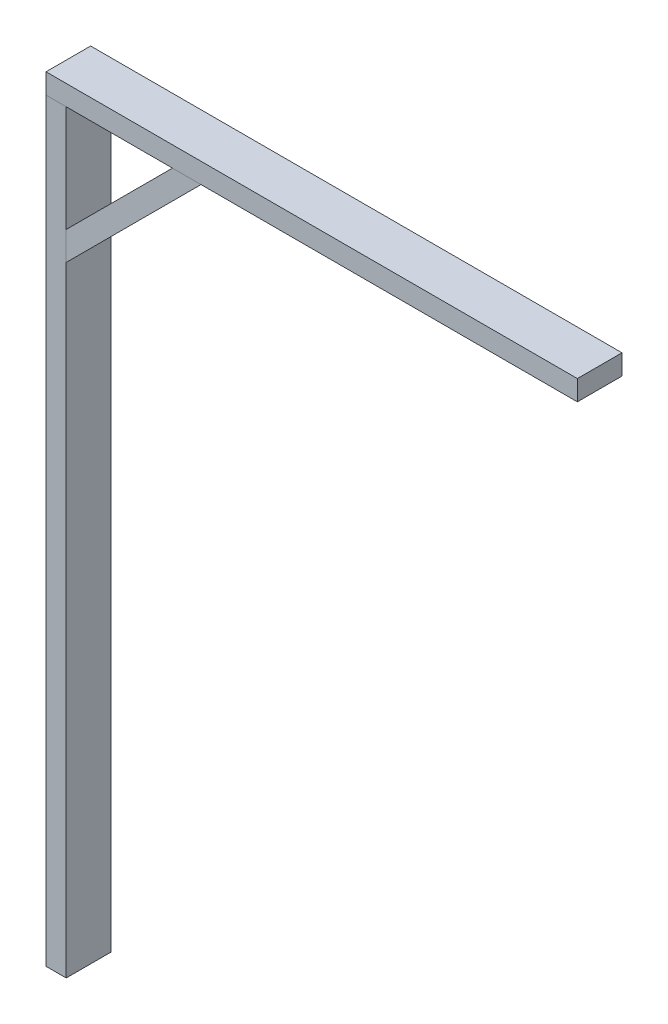
ISO-10303-21;
HEADER;
FILE_DESCRIPTION(('STEP AP214'),'2;1');
FILE_NAME('part.step','',(''),(''),'','','');
FILE_SCHEMA(('AUTOMOTIVE_DESIGN { 1 0 10303 214 1 1 1 1 }'));
ENDSEC;
DATA;
#1=APPLICATION_CONTEXT('core data for automotive mechanical design processes');
#2=APPLICATION_PROTOCOL_DEFINITION('international standard','automotive_design',2000,#1);
#3=PRODUCT_CONTEXT('',#1,'mechanical');
#4=PRODUCT('Part','Part','',(#3));
#5=PRODUCT_RELATED_PRODUCT_CATEGORY('part','',(#4));
#6=PRODUCT_DEFINITION_FORMATION('','',#4);
#7=PRODUCT_DEFINITION_CONTEXT('part definition',#1,'design');
#8=PRODUCT_DEFINITION('design','',#6,#7);
#9=PRODUCT_DEFINITION_SHAPE('','',#8);
#10=(LENGTH_UNIT() NAMED_UNIT(*) SI_UNIT(.MILLI.,.METRE.));
#11=(NAMED_UNIT(*) PLANE_ANGLE_UNIT() SI_UNIT($,.RADIAN.));
#12=(NAMED_UNIT(*) SI_UNIT($,.STERADIAN.) SOLID_ANGLE_UNIT());
#13=UNCERTAINTY_MEASURE_WITH_UNIT(LENGTH_MEASURE(1.E-05),#10,'distance_accuracy_value','');
#14=(GEOMETRIC_REPRESENTATION_CONTEXT(3) GLOBAL_UNCERTAINTY_ASSIGNED_CONTEXT((#13)) GLOBAL_UNIT_ASSIGNED_CONTEXT((#10,
#11,#12)) REPRESENTATION_CONTEXT('',''));
#15=CARTESIAN_POINT('',(0.,0.,0.));
#16=DIRECTION('',(0.,0.,1.));
#17=DIRECTION('',(1.,0.,0.));
#18=AXIS2_PLACEMENT_3D('',#15,#16,#17);
#19=CARTESIAN_POINT('',(490.5,710.,-21.));
#20=DIRECTION('',(0.,0.,-1.));
#21=DIRECTION('',(-1.,0.,0.));
#22=AXIS2_PLACEMENT_3D('',#19,#20,#21);
#23=PLANE('',#22);
#24=DIRECTION('',(-0.707106781186548,-0.707106781186547,0.));
#25=VECTOR('',#24,1.);
#26=CARTESIAN_POINT('',(109.5,710.,-21.));
#27=LINE('',#26,#25);
#28=CARTESIAN_POINT('',(109.5,710.,-21.));
#29=VERTEX_POINT('',#28);
#30=CARTESIAN_POINT('',(9.50000000000001,610.,-21.));
#31=VERTEX_POINT('',#30);
#32=EDGE_CURVE('E58',#29,#31,#27,.T.);
#33=ORIENTED_EDGE('',*,*,#32,.F.);
#34=DIRECTION('',(-1.,0.,0.));
#35=VECTOR('',#34,1.);
#36=CARTESIAN_POINT('',(109.5,710.,-21.));
#37=LINE('',#36,#35);
#38=CARTESIAN_POINT('',(136.370057685089,710.,-21.));
#39=VERTEX_POINT('',#38);
#40=EDGE_CURVE('E81',#39,#29,#37,.T.);
#41=ORIENTED_EDGE('',*,*,#40,.F.);
#42=DIRECTION('',(0.707106781186547,0.707106781186548,0.));
#43=VECTOR('',#42,1.);
#44=CARTESIAN_POINT('',(136.370057685089,710.,-21.));
#45=LINE('',#44,#43);
#46=CARTESIAN_POINT('',(9.5,583.129942314911,-21.));
#47=VERTEX_POINT('',#46);
#48=EDGE_CURVE('E86',#47,#39,#45,.T.);
#49=ORIENTED_EDGE('',*,*,#48,.F.);
#50=DIRECTION('',(0.,-1.,0.));
#51=VECTOR('',#50,1.);
#52=CARTESIAN_POINT('',(9.50000000000001,610.,-21.));
#53=LINE('',#52,#51);
#54=EDGE_CURVE('E101',#31,#47,#53,.T.);
#55=ORIENTED_EDGE('',*,*,#54,.F.);
#56=EDGE_LOOP('',(#33,#41,#49,#55));
#57=FACE_BOUND('',#56,.T.);
#58=ADVANCED_FACE('F50',(#57),#23,.T.);
#59=CARTESIAN_POINT('',(0.,0.,21.));
#60=DIRECTION('',(0.,0.,1.));
#61=DIRECTION('',(1.,0.,0.));
#62=AXIS2_PLACEMENT_3D('',#59,#60,#61);
#63=PLANE('',#62);
#64=DIRECTION('',(-0.707106781186548,-0.707106781186547,0.));
#65=VECTOR('',#64,1.);
#66=CARTESIAN_POINT('',(109.5,710.,21.));
#67=LINE('',#66,#65);
#68=CARTESIAN_POINT('',(109.5,710.,21.));
#69=VERTEX_POINT('',#68);
#70=CARTESIAN_POINT('',(9.50000000000001,610.,21.));
#71=VERTEX_POINT('',#70);
#72=EDGE_CURVE('E110',#69,#71,#67,.T.);
#73=ORIENTED_EDGE('',*,*,#72,.T.);
#74=DIRECTION('',(0.,-1.,0.));
#75=VECTOR('',#74,1.);
#76=CARTESIAN_POINT('',(9.50000000000001,610.,21.));
#77=LINE('',#76,#75);
#78=CARTESIAN_POINT('',(9.5,583.129942314911,21.));
#79=VERTEX_POINT('',#78);
#80=EDGE_CURVE('E99',#71,#79,#77,.T.);
#81=ORIENTED_EDGE('',*,*,#80,.T.);
#82=DIRECTION('',(0.707106781186547,0.707106781186548,0.));
#83=VECTOR('',#82,1.);
#84=CARTESIAN_POINT('',(136.370057685089,710.,21.));
#85=LINE('',#84,#83);
#86=CARTESIAN_POINT('',(136.370057685089,710.,21.));
#87=VERTEX_POINT('',#86);
#88=EDGE_CURVE('E102',#79,#87,#85,.T.);
#89=ORIENTED_EDGE('',*,*,#88,.T.);
#90=DIRECTION('',(-1.,0.,0.));
#91=VECTOR('',#90,1.);
#92=CARTESIAN_POINT('',(109.5,710.,21.));
#93=LINE('',#92,#91);
#94=EDGE_CURVE('E107',#87,#69,#93,.T.);
#95=ORIENTED_EDGE('',*,*,#94,.T.);
#96=EDGE_LOOP('',(#73,#81,#89,#95));
#97=FACE_BOUND('',#96,.T.);
#98=ADVANCED_FACE('F109',(#97),#63,.T.);
#99=CARTESIAN_POINT('',(9.50000000000001,610.,-200.42135623731));
#100=DIRECTION('',(-1.,0.,0.));
#101=DIRECTION('',(0.,-1.,0.));
#102=AXIS2_PLACEMENT_3D('',#99,#100,#101);
#103=PLANE('',#102);
#104=DIRECTION('',(0.,0.,1.));
#105=VECTOR('',#104,1.);
#106=CARTESIAN_POINT('',(9.50000000000001,610.,-200.42135623731));
#107=LINE('',#106,#105);
#108=EDGE_CURVE('E12',#31,#71,#107,.T.);
#109=ORIENTED_EDGE('',*,*,#108,.F.);
#110=ORIENTED_EDGE('',*,*,#54,.T.);
#111=DIRECTION('',(0.,0.,1.));
#112=VECTOR('',#111,1.);
#113=CARTESIAN_POINT('',(9.5,583.129942314911,-200.42135623731));
#114=LINE('',#113,#112);
#115=EDGE_CURVE('E96',#47,#79,#114,.T.);
#116=ORIENTED_EDGE('',*,*,#115,.T.);
#117=ORIENTED_EDGE('',*,*,#80,.F.);
#118=EDGE_LOOP('',(#109,#110,#116,#117));
#119=FACE_BOUND('',#118,.T.);
#120=ADVANCED_FACE('F97',(#119),#103,.T.);
#121=CARTESIAN_POINT('',(136.370057685089,710.,-200.42135623731));
#122=DIRECTION('',(0.707106781186548,-0.707106781186547,0.));
#123=DIRECTION('',(0.707106781186547,0.707106781186548,0.));
#124=AXIS2_PLACEMENT_3D('',#121,#122,#123);
#125=PLANE('',#124);
#126=ORIENTED_EDGE('',*,*,#115,.F.);
#127=ORIENTED_EDGE('',*,*,#48,.T.);
#128=DIRECTION('',(0.,0.,1.));
#129=VECTOR('',#128,1.);
#130=CARTESIAN_POINT('',(136.370057685089,710.,-200.42135623731));
#131=LINE('',#130,#129);
#132=EDGE_CURVE('E91',#39,#87,#131,.T.);
#133=ORIENTED_EDGE('',*,*,#132,.T.);
#134=ORIENTED_EDGE('',*,*,#88,.F.);
#135=EDGE_LOOP('',(#126,#127,#133,#134));
#136=FACE_BOUND('',#135,.T.);
#137=ADVANCED_FACE('F103',(#136),#125,.T.);
#138=CARTESIAN_POINT('',(109.5,710.,-200.42135623731));
#139=DIRECTION('',(0.,1.,0.));
#140=DIRECTION('',(0.,0.,1.));
#141=AXIS2_PLACEMENT_3D('',#138,#139,#140);
#142=PLANE('',#141);
#143=ORIENTED_EDGE('',*,*,#132,.F.);
#144=ORIENTED_EDGE('',*,*,#40,.T.);
#145=DIRECTION('',(0.,0.,1.));
#146=VECTOR('',#145,1.);
#147=CARTESIAN_POINT('',(109.5,710.,-200.42135623731));
#148=LINE('',#147,#146);
#149=EDGE_CURVE('E117',#29,#69,#148,.T.);
#150=ORIENTED_EDGE('',*,*,#149,.T.);
#151=ORIENTED_EDGE('',*,*,#94,.F.);
#152=EDGE_LOOP('',(#143,#144,#150,#151));
#153=FACE_BOUND('',#152,.T.);
#154=ADVANCED_FACE('F123',(#153),#142,.T.);
#155=CARTESIAN_POINT('',(109.5,710.,-200.42135623731));
#156=DIRECTION('',(-0.707106781186547,0.707106781186548,0.));
#157=DIRECTION('',(-0.707106781186548,-0.707106781186547,0.));
#158=AXIS2_PLACEMENT_3D('',#155,#156,#157);
#159=PLANE('',#158);
#160=ORIENTED_EDGE('',*,*,#149,.F.);
#161=ORIENTED_EDGE('',*,*,#32,.T.);
#162=ORIENTED_EDGE('',*,*,#108,.T.);
#163=ORIENTED_EDGE('',*,*,#72,.F.);
#164=EDGE_LOOP('',(#160,#161,#162,#163));
#165=FACE_BOUND('',#164,.T.);
#166=ADVANCED_FACE('F124',(#165),#159,.T.);
#167=CLOSED_SHELL('',(#58,#98,#120,#137,#154,#166));
#168=MANIFOLD_SOLID_BREP('B2',#167);
#169=CARTESIAN_POINT('',(490.5,710.,-21.));
#170=DIRECTION('',(0.,0.,-1.));
#171=DIRECTION('',(-1.,0.,0.));
#172=AXIS2_PLACEMENT_3D('',#169,#170,#171);
#173=PLANE('',#172);
#174=DIRECTION('',(0.,-1.,0.));
#175=VECTOR('',#174,1.);
#176=CARTESIAN_POINT('',(-9.5,710.,-21.));
#177=LINE('',#176,#175);
#178=CARTESIAN_POINT('',(-9.5,729.,-21.));
#179=VERTEX_POINT('',#178);
#180=CARTESIAN_POINT('',(-9.5,710.,-21.));
#181=VERTEX_POINT('',#180);
#182=EDGE_CURVE('E247',#179,#181,#177,.T.);
#183=ORIENTED_EDGE('',*,*,#182,.F.);
#184=DIRECTION('',(-1.,0.,0.));
#185=VECTOR('',#184,1.);
#186=CARTESIAN_POINT('',(490.5,729.,-21.));
#187=LINE('',#186,#185);
#188=CARTESIAN_POINT('',(490.5,729.,-21.));
#189=VERTEX_POINT('',#188);
#190=EDGE_CURVE('E48',#189,#179,#187,.T.);
#191=ORIENTED_EDGE('',*,*,#190,.F.);
#192=DIRECTION('',(0.,-1.,0.));
#193=VECTOR('',#192,1.);
#194=CARTESIAN_POINT('',(490.5,710.,-21.));
#195=LINE('',#194,#193);
#196=CARTESIAN_POINT('',(490.5,710.,-21.));
#197=VERTEX_POINT('',#196);
#198=EDGE_CURVE('E241',#189,#197,#195,.T.);
#199=ORIENTED_EDGE('',*,*,#198,.T.);
#200=DIRECTION('',(-1.,0.,0.));
#201=VECTOR('',#200,1.);
#202=CARTESIAN_POINT('',(490.5,710.,-21.));
#203=LINE('',#202,#201);
#204=EDGE_CURVE('E186',#197,#181,#203,.T.);
#205=ORIENTED_EDGE('',*,*,#204,.T.);
#206=EDGE_LOOP('',(#183,#191,#199,#205));
#207=FACE_BOUND('',#206,.T.);
#208=ADVANCED_FACE('F183',(#207),#173,.T.);
#209=CARTESIAN_POINT('',(490.5,729.,-21.));
#210=DIRECTION('',(0.,1.,0.));
#211=DIRECTION('',(0.,0.,1.));
#212=AXIS2_PLACEMENT_3D('',#209,#210,#211);
#213=PLANE('',#212);
#214=DIRECTION('',(0.,0.,-1.));
#215=VECTOR('',#214,1.);
#216=CARTESIAN_POINT('',(-9.5,729.,-21.));
#217=LINE('',#216,#215);
#218=CARTESIAN_POINT('',(-9.5,729.,21.));
#219=VERTEX_POINT('',#218);
#220=EDGE_CURVE('E243',#219,#179,#217,.T.);
#221=ORIENTED_EDGE('',*,*,#220,.F.);
#222=DIRECTION('',(-1.,0.,0.));
#223=VECTOR('',#222,1.);
#224=CARTESIAN_POINT('',(490.5,729.,21.));
#225=LINE('',#224,#223);
#226=CARTESIAN_POINT('',(490.5,729.,21.));
#227=VERTEX_POINT('',#226);
#228=EDGE_CURVE('E192',#227,#219,#225,.T.);
#229=ORIENTED_EDGE('',*,*,#228,.F.);
#230=DIRECTION('',(0.,0.,-1.));
#231=VECTOR('',#230,1.);
#232=CARTESIAN_POINT('',(490.5,729.,-21.));
#233=LINE('',#232,#231);
#234=EDGE_CURVE('E238',#227,#189,#233,.T.);
#235=ORIENTED_EDGE('',*,*,#234,.T.);
#236=ORIENTED_EDGE('',*,*,#190,.T.);
#237=EDGE_LOOP('',(#221,#229,#235,#236));
#238=FACE_BOUND('',#237,.T.);
#239=ADVANCED_FACE('F257',(#238),#213,.T.);
#240=CARTESIAN_POINT('',(490.5,710.,21.));
#241=DIRECTION('',(0.,0.,1.));
#242=DIRECTION('',(1.,0.,0.));
#243=AXIS2_PLACEMENT_3D('',#240,#241,#242);
#244=PLANE('',#243);
#245=DIRECTION('',(0.,1.,0.));
#246=VECTOR('',#245,1.);
#247=CARTESIAN_POINT('',(-9.5,710.,21.));
#248=LINE('',#247,#246);
#249=CARTESIAN_POINT('',(-9.5,710.,21.));
#250=VERTEX_POINT('',#249);
#251=EDGE_CURVE('E233',#250,#219,#248,.T.);
#252=ORIENTED_EDGE('',*,*,#251,.F.);
#253=DIRECTION('',(-1.,0.,0.));
#254=VECTOR('',#253,1.);
#255=CARTESIAN_POINT('',(490.5,710.,21.));
#256=LINE('',#255,#254);
#257=CARTESIAN_POINT('',(490.5,710.,21.));
#258=VERTEX_POINT('',#257);
#259=EDGE_CURVE('E228',#258,#250,#256,.T.);
#260=ORIENTED_EDGE('',*,*,#259,.F.);
#261=DIRECTION('',(0.,1.,0.));
#262=VECTOR('',#261,1.);
#263=CARTESIAN_POINT('',(490.5,710.,21.));
#264=LINE('',#263,#262);
#265=EDGE_CURVE('E231',#258,#227,#264,.T.);
#266=ORIENTED_EDGE('',*,*,#265,.T.);
#267=ORIENTED_EDGE('',*,*,#228,.T.);
#268=EDGE_LOOP('',(#252,#260,#266,#267));
#269=FACE_BOUND('',#268,.T.);
#270=ADVANCED_FACE('F230',(#269),#244,.T.);
#271=CARTESIAN_POINT('',(490.5,710.,-21.));
#272=DIRECTION('',(0.,-1.,0.));
#273=DIRECTION('',(0.,0.,-1.));
#274=AXIS2_PLACEMENT_3D('',#271,#272,#273);
#275=PLANE('',#274);
#276=DIRECTION('',(0.,0.,1.));
#277=VECTOR('',#276,1.);
#278=CARTESIAN_POINT('',(-9.5,710.,-21.));
#279=LINE('',#278,#277);
#280=EDGE_CURVE('E250',#181,#250,#279,.T.);
#281=ORIENTED_EDGE('',*,*,#280,.F.);
#282=ORIENTED_EDGE('',*,*,#204,.F.);
#283=DIRECTION('',(0.,0.,1.));
#284=VECTOR('',#283,1.);
#285=CARTESIAN_POINT('',(490.5,710.,-21.));
#286=LINE('',#285,#284);
#287=EDGE_CURVE('E237',#197,#258,#286,.T.);
#288=ORIENTED_EDGE('',*,*,#287,.T.);
#289=ORIENTED_EDGE('',*,*,#259,.T.);
#290=EDGE_LOOP('',(#281,#282,#288,#289));
#291=FACE_BOUND('',#290,.T.);
#292=ADVANCED_FACE('F240',(#291),#275,.T.);
#293=CARTESIAN_POINT('',(490.5,0.,0.));
#294=DIRECTION('',(1.,0.,0.));
#295=DIRECTION('',(0.,0.,-1.));
#296=AXIS2_PLACEMENT_3D('',#293,#294,#295);
#297=PLANE('',#296);
#298=ORIENTED_EDGE('',*,*,#198,.F.);
#299=ORIENTED_EDGE('',*,*,#234,.F.);
#300=ORIENTED_EDGE('',*,*,#265,.F.);
#301=ORIENTED_EDGE('',*,*,#287,.F.);
#302=EDGE_LOOP('',(#298,#299,#300,#301));
#303=FACE_BOUND('',#302,.T.);
#304=ADVANCED_FACE('F236',(#303),#297,.T.);
#305=CARTESIAN_POINT('',(-9.5,0.,0.));
#306=DIRECTION('',(1.,0.,0.));
#307=DIRECTION('',(0.,0.,-1.));
#308=AXIS2_PLACEMENT_3D('',#305,#306,#307);
#309=PLANE('',#308);
#310=ORIENTED_EDGE('',*,*,#182,.T.);
#311=ORIENTED_EDGE('',*,*,#280,.T.);
#312=ORIENTED_EDGE('',*,*,#251,.T.);
#313=ORIENTED_EDGE('',*,*,#220,.T.);
#314=EDGE_LOOP('',(#310,#311,#312,#313));
#315=FACE_BOUND('',#314,.T.);
#316=ADVANCED_FACE('F256',(#315),#309,.F.);
#317=CLOSED_SHELL('',(#208,#239,#270,#292,#304,#316));
#318=MANIFOLD_SOLID_BREP('B6',#317);
#319=CARTESIAN_POINT('',(-9.5,710.,21.));
#320=DIRECTION('',(1.,0.,0.));
#321=DIRECTION('',(0.,0.,-1.));
#322=AXIS2_PLACEMENT_3D('',#319,#320,#321);
#323=PLANE('',#322);
#324=DIRECTION('',(0.,0.,1.));
#325=VECTOR('',#324,1.);
#326=CARTESIAN_POINT('',(-9.5,0.,21.));
#327=LINE('',#326,#325);
#328=CARTESIAN_POINT('',(-9.5,0.,-21.));
#329=VERTEX_POINT('',#328);
#330=CARTESIAN_POINT('',(-9.5,0.,21.));
#331=VERTEX_POINT('',#330);
#332=EDGE_CURVE('E375',#329,#331,#327,.T.);
#333=ORIENTED_EDGE('',*,*,#332,.T.);
#334=DIRECTION('',(0.,-1.,0.));
#335=VECTOR('',#334,1.);
#336=CARTESIAN_POINT('',(-9.5,710.,21.));
#337=LINE('',#336,#335);
#338=CARTESIAN_POINT('',(-9.5,710.,21.));
#339=VERTEX_POINT('',#338);
#340=EDGE_CURVE('E181',#339,#331,#337,.T.);
#341=ORIENTED_EDGE('',*,*,#340,.F.);
#342=DIRECTION('',(0.,0.,1.));
#343=VECTOR('',#342,1.);
#344=CARTESIAN_POINT('',(-9.5,710.,21.));
#345=LINE('',#344,#343);
#346=CARTESIAN_POINT('',(-9.5,710.,-21.));
#347=VERTEX_POINT('',#346);
#348=EDGE_CURVE('E359',#347,#339,#345,.T.);
#349=ORIENTED_EDGE('',*,*,#348,.F.);
#350=DIRECTION('',(0.,-1.,0.));
#351=VECTOR('',#350,1.);
#352=CARTESIAN_POINT('',(-9.5,710.,-21.));
#353=LINE('',#352,#351);
#354=EDGE_CURVE('E371',#347,#329,#353,.T.);
#355=ORIENTED_EDGE('',*,*,#354,.T.);
#356=EDGE_LOOP('',(#333,#341,#349,#355));
#357=FACE_BOUND('',#356,.T.);
#358=ADVANCED_FACE('F307',(#357),#323,.F.);
#359=CARTESIAN_POINT('',(9.5,710.,21.));
#360=DIRECTION('',(0.,0.,-1.));
#361=DIRECTION('',(-1.,0.,0.));
#362=AXIS2_PLACEMENT_3D('',#359,#360,#361);
#363=PLANE('',#362);
#364=DIRECTION('',(1.,0.,0.));
#365=VECTOR('',#364,1.);
#366=CARTESIAN_POINT('',(9.5,0.,21.));
#367=LINE('',#366,#365);
#368=CARTESIAN_POINT('',(9.5,0.,21.));
#369=VERTEX_POINT('',#368);
#370=EDGE_CURVE('E364',#331,#369,#367,.T.);
#371=ORIENTED_EDGE('',*,*,#370,.T.);
#372=DIRECTION('',(0.,-1.,0.));
#373=VECTOR('',#372,1.);
#374=CARTESIAN_POINT('',(9.5,710.,21.));
#375=LINE('',#374,#373);
#376=CARTESIAN_POINT('',(9.5,710.,21.));
#377=VERTEX_POINT('',#376);
#378=EDGE_CURVE('E316',#377,#369,#375,.T.);
#379=ORIENTED_EDGE('',*,*,#378,.F.);
#380=DIRECTION('',(1.,0.,0.));
#381=VECTOR('',#380,1.);
#382=CARTESIAN_POINT('',(9.5,710.,21.));
#383=LINE('',#382,#381);
#384=EDGE_CURVE('E354',#339,#377,#383,.T.);
#385=ORIENTED_EDGE('',*,*,#384,.F.);
#386=ORIENTED_EDGE('',*,*,#340,.T.);
#387=EDGE_LOOP('',(#371,#379,#385,#386));
#388=FACE_BOUND('',#387,.T.);
#389=ADVANCED_FACE('F363',(#388),#363,.F.);
#390=CARTESIAN_POINT('',(9.5,710.,21.));
#391=DIRECTION('',(-1.,0.,0.));
#392=DIRECTION('',(0.,0.,1.));
#393=AXIS2_PLACEMENT_3D('',#390,#391,#392);
#394=PLANE('',#393);
#395=DIRECTION('',(0.,0.,-1.));
#396=VECTOR('',#395,1.);
#397=CARTESIAN_POINT('',(9.5,0.,21.));
#398=LINE('',#397,#396);
#399=CARTESIAN_POINT('',(9.5,0.,-21.));
#400=VERTEX_POINT('',#399);
#401=EDGE_CURVE('E341',#369,#400,#398,.T.);
#402=ORIENTED_EDGE('',*,*,#401,.T.);
#403=DIRECTION('',(0.,-1.,0.));
#404=VECTOR('',#403,1.);
#405=CARTESIAN_POINT('',(9.5,710.,-21.));
#406=LINE('',#405,#404);
#407=CARTESIAN_POINT('',(9.5,710.,-21.));
#408=VERTEX_POINT('',#407);
#409=EDGE_CURVE('E366',#408,#400,#406,.T.);
#410=ORIENTED_EDGE('',*,*,#409,.F.);
#411=DIRECTION('',(0.,0.,-1.));
#412=VECTOR('',#411,1.);
#413=CARTESIAN_POINT('',(9.5,710.,21.));
#414=LINE('',#413,#412);
#415=EDGE_CURVE('E357',#377,#408,#414,.T.);
#416=ORIENTED_EDGE('',*,*,#415,.F.);
#417=ORIENTED_EDGE('',*,*,#378,.T.);
#418=EDGE_LOOP('',(#402,#410,#416,#417));
#419=FACE_BOUND('',#418,.T.);
#420=ADVANCED_FACE('F367',(#419),#394,.F.);
#421=CARTESIAN_POINT('',(9.5,710.,-21.));
#422=DIRECTION('',(0.,0.,1.));
#423=DIRECTION('',(1.,0.,0.));
#424=AXIS2_PLACEMENT_3D('',#421,#422,#423);
#425=PLANE('',#424);
#426=DIRECTION('',(-1.,0.,0.));
#427=VECTOR('',#426,1.);
#428=CARTESIAN_POINT('',(9.5,0.,-21.));
#429=LINE('',#428,#427);
#430=EDGE_CURVE('E347',#400,#329,#429,.T.);
#431=ORIENTED_EDGE('',*,*,#430,.T.);
#432=ORIENTED_EDGE('',*,*,#354,.F.);
#433=DIRECTION('',(-1.,0.,0.));
#434=VECTOR('',#433,1.);
#435=CARTESIAN_POINT('',(9.5,710.,-21.));
#436=LINE('',#435,#434);
#437=EDGE_CURVE('E324',#408,#347,#436,.T.);
#438=ORIENTED_EDGE('',*,*,#437,.F.);
#439=ORIENTED_EDGE('',*,*,#409,.T.);
#440=EDGE_LOOP('',(#431,#432,#438,#439));
#441=FACE_BOUND('',#440,.T.);
#442=ADVANCED_FACE('F388',(#441),#425,.F.);
#443=CARTESIAN_POINT('',(0.,710.,0.));
#444=DIRECTION('',(0.,1.,0.));
#445=DIRECTION('',(0.,0.,1.));
#446=AXIS2_PLACEMENT_3D('',#443,#444,#445);
#447=PLANE('',#446);
#448=ORIENTED_EDGE('',*,*,#348,.T.);
#449=ORIENTED_EDGE('',*,*,#384,.T.);
#450=ORIENTED_EDGE('',*,*,#415,.T.);
#451=ORIENTED_EDGE('',*,*,#437,.T.);
#452=EDGE_LOOP('',(#448,#449,#450,#451));
#453=FACE_BOUND('',#452,.T.);
#454=ADVANCED_FACE('F355',(#453),#447,.T.);
#455=CARTESIAN_POINT('',(0.,0.,0.));
#456=DIRECTION('',(0.,1.,0.));
#457=DIRECTION('',(0.,0.,1.));
#458=AXIS2_PLACEMENT_3D('',#455,#456,#457);
#459=PLANE('',#458);
#460=ORIENTED_EDGE('',*,*,#332,.F.);
#461=ORIENTED_EDGE('',*,*,#430,.F.);
#462=ORIENTED_EDGE('',*,*,#401,.F.);
#463=ORIENTED_EDGE('',*,*,#370,.F.);
#464=EDGE_LOOP('',(#460,#461,#462,#463));
#465=FACE_BOUND('',#464,.T.);
#466=ADVANCED_FACE('F391',(#465),#459,.F.);
#467=CLOSED_SHELL('',(#358,#389,#420,#442,#454,#466));
#468=MANIFOLD_SOLID_BREP('B42',#467);
#469=ADVANCED_BREP_SHAPE_REPRESENTATION('',(#18,#168,#318,#468),#14);
#470=SHAPE_DEFINITION_REPRESENTATION(#9,#469);
ENDSEC;
END-ISO-10303-21;
